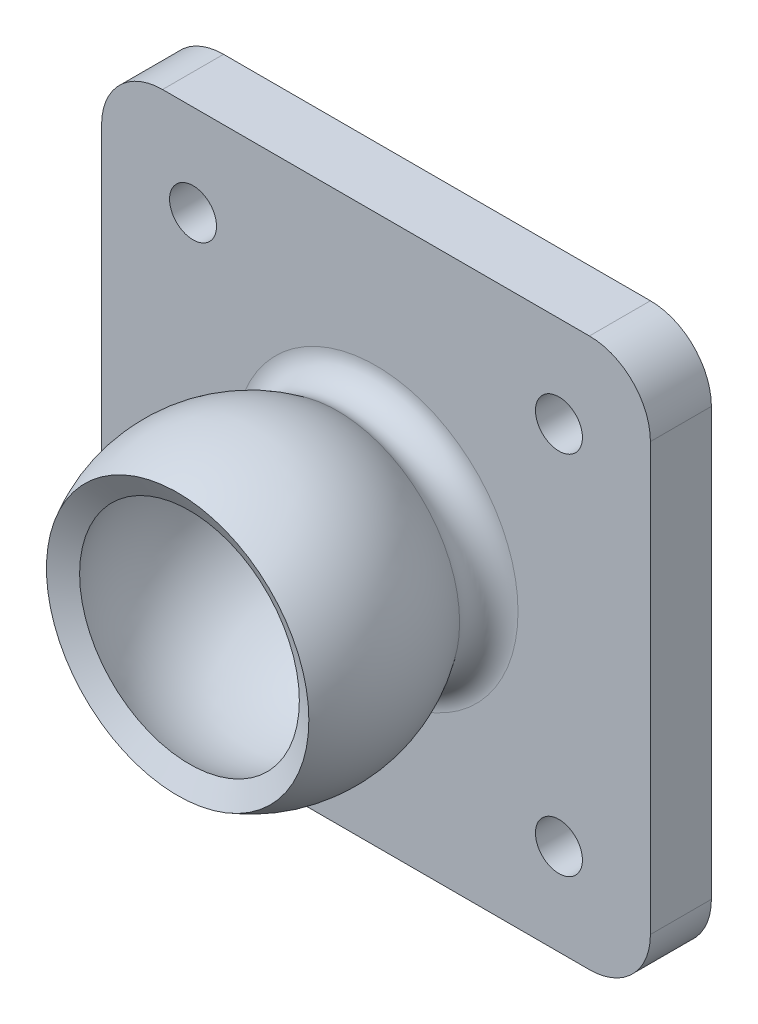
ISO-10303-21;
HEADER;
FILE_DESCRIPTION(('STEP AP214'),'2;1');
FILE_NAME('part.step','',(''),(''),'','','');
FILE_SCHEMA(('AUTOMOTIVE_DESIGN { 1 0 10303 214 1 1 1 1 }'));
ENDSEC;
DATA;
#1=APPLICATION_CONTEXT('core data for automotive mechanical design processes');
#2=APPLICATION_PROTOCOL_DEFINITION('international standard','automotive_design',2000,#1);
#3=PRODUCT_CONTEXT('',#1,'mechanical');
#4=PRODUCT('Part','Part','',(#3));
#5=PRODUCT_RELATED_PRODUCT_CATEGORY('part','',(#4));
#6=PRODUCT_DEFINITION_FORMATION('','',#4);
#7=PRODUCT_DEFINITION_CONTEXT('part definition',#1,'design');
#8=PRODUCT_DEFINITION('design','',#6,#7);
#9=PRODUCT_DEFINITION_SHAPE('','',#8);
#10=(LENGTH_UNIT() NAMED_UNIT(*) SI_UNIT(.MILLI.,.METRE.));
#11=(NAMED_UNIT(*) PLANE_ANGLE_UNIT() SI_UNIT($,.RADIAN.));
#12=(NAMED_UNIT(*) SI_UNIT($,.STERADIAN.) SOLID_ANGLE_UNIT());
#13=UNCERTAINTY_MEASURE_WITH_UNIT(LENGTH_MEASURE(1.E-05),#10,'distance_accuracy_value','');
#14=(GEOMETRIC_REPRESENTATION_CONTEXT(3) GLOBAL_UNCERTAINTY_ASSIGNED_CONTEXT((#13)) GLOBAL_UNIT_ASSIGNED_CONTEXT((#10,
#11,#12)) REPRESENTATION_CONTEXT('',''));
#15=CARTESIAN_POINT('',(0.,0.,0.));
#16=DIRECTION('',(0.,0.,1.));
#17=DIRECTION('',(1.,0.,0.));
#18=AXIS2_PLACEMENT_3D('',#15,#16,#17);
#19=CARTESIAN_POINT('',(0.,0.,15.3));
#20=DIRECTION('',(0.,0.,-1.));
#21=DIRECTION('',(-1.,0.,0.));
#22=AXIS2_PLACEMENT_3D('',#19,#20,#21);
#23=SPHERICAL_SURFACE('',#22,10.3);
#24=CARTESIAN_POINT('',(0.,0.,5.));
#25=VERTEX_POINT('',#24);
#26=VERTEX_LOOP('',#25);
#27=FACE_BOUND('',#26,.T.);
#28=CARTESIAN_POINT('',(0.,0.,20.2935390885373));
#29=DIRECTION('',(0.,0.,-1.));
#30=DIRECTION('',(-1.,0.,0.));
#31=AXIS2_PLACEMENT_3D('',#28,#29,#30);
#32=CIRCLE('',#31,9.00858298353579);
#33=CARTESIAN_POINT('',(-9.00858298353579,0.,20.2935390885373));
#34=VERTEX_POINT('',#33);
#35=EDGE_CURVE('E49',#34,#34,#32,.T.);
#36=ORIENTED_EDGE('',*,*,#35,.F.);
#37=EDGE_LOOP('',(#36));
#38=FACE_BOUND('',#37,.T.);
#39=ADVANCED_FACE('F45',(#27,#38),#23,.F.);
#40=CARTESIAN_POINT('',(0.,0.,21.2631583290299));
#41=DIRECTION('',(0.,0.,1.));
#42=DIRECTION('',(1.,0.,0.));
#43=AXIS2_PLACEMENT_3D('',#40,#41,#42);
#44=CONICAL_SURFACE('',#43,10.7578223978146,1.06465084371654);
#45=CARTESIAN_POINT('',(0.,0.,21.2631583290299));
#46=DIRECTION('',(0.,0.,-1.));
#47=DIRECTION('',(-1.,0.,0.));
#48=AXIS2_PLACEMENT_3D('',#45,#46,#47);
#49=CIRCLE('',#48,10.7578223978146);
#50=CARTESIAN_POINT('',(10.7578223978146,0.,21.2631583290299));
#51=VERTEX_POINT('',#50);
#52=EDGE_CURVE('E124',#51,#51,#49,.T.);
#53=ORIENTED_EDGE('',*,*,#52,.F.);
#54=EDGE_LOOP('',(#53));
#55=FACE_BOUND('',#54,.T.);
#56=ORIENTED_EDGE('',*,*,#35,.T.);
#57=EDGE_LOOP('',(#56));
#58=FACE_BOUND('',#57,.T.);
#59=ADVANCED_FACE('F117',(#55,#58),#44,.F.);
#60=CARTESIAN_POINT('',(0.,0.,15.3));
#61=DIRECTION('',(0.,0.,-1.));
#62=DIRECTION('',(1.,0.,0.));
#63=AXIS2_PLACEMENT_3D('',#60,#61,#62);
#64=SPHERICAL_SURFACE('',#63,12.3);
#65=CARTESIAN_POINT('',(0.,0.,8.16083916083916));
#66=DIRECTION('',(0.,0.,1.));
#67=DIRECTION('',(1.,0.,0.));
#68=AXIS2_PLACEMENT_3D('',#65,#66,#67);
#69=CIRCLE('',#68,10.0161061552178);
#70=CARTESIAN_POINT('',(10.0161061552178,0.,8.16083916083916));
#71=VERTEX_POINT('',#70);
#72=EDGE_CURVE('E55',#71,#71,#69,.T.);
#73=CARTESIAN_POINT('',(10.0161061552178,0.,8.16083916083916));
#74=CARTESIAN_POINT('',(10.0997980883156,0.,8.27825540371457));
#75=CARTESIAN_POINT('',(10.1814234987795,0.,8.39714451375462));
#76=CARTESIAN_POINT('',(10.3404444546911,0.,8.63771871213522));
#77=CARTESIAN_POINT('',(10.4178400001386,0.,8.75940380047577));
#78=CARTESIAN_POINT('',(10.5683044062684,0.,9.00542019942862));
#79=CARTESIAN_POINT('',(10.6413732669507,0.,9.12975151004092));
#80=CARTESIAN_POINT('',(10.7830942362201,0.,9.3809063984481));
#81=CARTESIAN_POINT('',(10.8517463448071,0.,9.50772997624298));
#82=CARTESIAN_POINT('',(10.9845488291381,0.,9.76371261002001));
#83=CARTESIAN_POINT('',(11.0486992048822,0.,9.89287166600217));
#84=CARTESIAN_POINT('',(11.1724189106616,0.,10.1533655123758));
#85=CARTESIAN_POINT('',(11.2319882406971,0.,10.2847003027673));
#86=CARTESIAN_POINT('',(11.3464721805628,0.,10.5493832012965));
#87=CARTESIAN_POINT('',(11.4013867903931,0.,10.6827313094342));
#88=CARTESIAN_POINT('',(11.5064933790232,0.,10.9512759321669));
#89=CARTESIAN_POINT('',(11.5566853578231,0.,11.0864724467618));
#90=CARTESIAN_POINT('',(11.6522846120621,0.,11.3585466864937));
#91=CARTESIAN_POINT('',(11.6976918875011,0.,11.4954244116306));
#92=CARTESIAN_POINT('',(11.783665580402,0.,11.7706917970519));
#93=CARTESIAN_POINT('',(11.8242319978638,0.,11.9090814573363));
#94=CARTESIAN_POINT('',(11.9004738066954,0.,12.1872015679547));
#95=CARTESIAN_POINT('',(11.9361491980652,0.,12.3269320182888));
#96=CARTESIAN_POINT('',(12.002564835319,0.,12.6075609057425));
#97=CARTESIAN_POINT('',(12.033305081203,0.,12.7484593428622));
#98=CARTESIAN_POINT('',(12.0898124113263,0.,13.0312499561919));
#99=CARTESIAN_POINT('',(12.1155794955657,0.,13.1731421324019));
#100=CARTESIAN_POINT('',(12.1621086365037,0.,13.4577447472682));
#101=CARTESIAN_POINT('',(12.1828706932022,0.,13.6004551859244));
#102=CARTESIAN_POINT('',(12.219364102829,0.,13.8865178371023));
#103=CARTESIAN_POINT('',(12.2350954557573,0.,14.0298700496239));
#104=CARTESIAN_POINT('',(12.2615080030361,0.,14.3170389662764));
#105=CARTESIAN_POINT('',(12.2721891973864,0.,14.4608556704073));
#106=CARTESIAN_POINT('',(12.2884882181824,0.,14.7487757135897));
#107=CARTESIAN_POINT('',(12.294106044628,0.,14.8928790526414));
#108=CARTESIAN_POINT('',(12.3002713821042,0.,15.1811941544986));
#109=CARTESIAN_POINT('',(12.3008188931348,0.,15.3254059173041));
#110=CARTESIAN_POINT('',(12.2968429226797,0.,15.6137595214156));
#111=CARTESIAN_POINT('',(12.2923194411939,0.,15.7579013627214));
#112=CARTESIAN_POINT('',(12.2782070798506,0.,16.0459368650514));
#113=CARTESIAN_POINT('',(12.2686181999932,0.,16.1898305260754));
#114=CARTESIAN_POINT('',(12.2443869003784,0.,16.4771917159811));
#115=CARTESIAN_POINT('',(12.2297444806211,0.,16.6206592448628));
#116=CARTESIAN_POINT('',(12.1954242093437,0.,16.9069907456181));
#117=CARTESIAN_POINT('',(12.1757463578237,0.,17.0498547174918));
#118=CARTESIAN_POINT('',(12.131379558416,0.,17.3348024257729));
#119=CARTESIAN_POINT('',(12.1066906105283,0.,17.4768861621803));
#120=CARTESIAN_POINT('',(12.052332150993,0.,17.7600976860007));
#121=CARTESIAN_POINT('',(12.0226626393454,0.,17.9012254734135));
#122=CARTESIAN_POINT('',(11.9583797441634,0.,18.1823505678532));
#123=CARTESIAN_POINT('',(11.9237663606289,0.,18.32234787488));
#124=CARTESIAN_POINT('',(11.8496385281374,0.,18.6010388754922));
#125=CARTESIAN_POINT('',(11.8101240791804,0.,18.7397325690775));
#126=CARTESIAN_POINT('',(11.7262429813392,0.,19.0156448208642));
#127=CARTESIAN_POINT('',(11.6818763324549,0.,19.1528633790654));
#128=CARTESIAN_POINT('',(11.5883457086397,0.,19.4256556663563));
#129=CARTESIAN_POINT('',(11.5391817337088,0.,19.5612293954461));
#130=CARTESIAN_POINT('',(11.4361172356823,0.,19.8305643502635));
#131=CARTESIAN_POINT('',(11.3822167125868,0.,19.9643255759911));
#132=CARTESIAN_POINT('',(11.2697458612535,0.,20.2298701460765));
#133=CARTESIAN_POINT('',(11.2111755330157,0.,20.3616534904342));
#134=CARTESIAN_POINT('',(11.0894371883326,0.,20.623079161514));
#135=CARTESIAN_POINT('',(11.0262691718873,0.,20.7527214882362));
#136=CARTESIAN_POINT('',(10.8954147508978,0.,21.0097053979523));
#137=CARTESIAN_POINT('',(10.8277283463537,0.,21.1370469809463));
#138=CARTESIAN_POINT('',(10.7578223978146,0.,21.2631583290299));
#139=B_SPLINE_CURVE_WITH_KNOTS('',3,(#73,#74,#75,#76,#77,#78,#79,#80,#81,#82,#83,#84,#85,#86,
#87,#88,#89,#90,#91,#92,#93,#94,#95,#96,#97,#98,#99,#100,#101,#102,#103,#104,#105,#106,#107,
#108,#109,#110,#111,#112,#113,#114,#115,#116,#117,#118,#119,#120,#121,#122,#123,#124,#125,#126,
#127,#128,#129,#130,#131,#132,#133,#134,#135,#136,#137,#138),.UNSPECIFIED.,.F.,.F.,(4,2,2,2,2,2,
2,2,2,2,2,2,2,2,2,2,2,2,2,2,2,2,2,2,2,2,2,2,2,2,2,2,4),(0.,0.432549233137449,0.865098466274895,
1.29764769941234,1.73019693254979,2.16274616568724,2.59529539882468,3.02784463196213,
3.46039386509958,3.89294309823702,4.32549233137447,4.75804156451192,5.19059079764936,
5.62314003078681,6.05568926392426,6.4882384970617,6.92078773019915,7.3533369633366,
7.78588619647405,8.21843542961149,8.65098466274894,9.08353389588638,9.51608312902383,
9.94863236216128,10.3811815952987,10.8137308284362,11.2462800615736,11.6788292947111,
12.1113785278485,12.543927760986,12.9764769941234,13.4090262272609,13.8415754603983),.UNSPECIFIED.);
#140=EDGE_CURVE('BSEAM245',#71,#51,#139,.T.);
#141=ORIENTED_EDGE('',*,*,#72,.T.);
#142=ORIENTED_EDGE('',*,*,#52,.T.);
#143=ORIENTED_EDGE('',*,*,#140,.T.);
#144=ORIENTED_EDGE('',*,*,#140,.F.);
#145=EDGE_LOOP('',(#141,#143,#142,#144));
#146=FACE_BOUND('',#145,.T.);
#147=ADVANCED_FACE('F245',(#146),#64,.T.);
#148=CARTESIAN_POINT('',(22.5,-22.5,5.));
#149=DIRECTION('',(-1.,0.,0.));
#150=DIRECTION('',(0.,0.,1.));
#151=AXIS2_PLACEMENT_3D('',#148,#149,#150);
#152=PLANE('',#151);
#153=DIRECTION('',(0.,1.,0.));
#154=VECTOR('',#153,1.);
#155=CARTESIAN_POINT('',(22.5,-22.5,5.));
#156=LINE('',#155,#154);
#157=CARTESIAN_POINT('',(22.5,-17.5,5.));
#158=VERTEX_POINT('',#157);
#159=CARTESIAN_POINT('',(22.5,17.5,5.));
#160=VERTEX_POINT('',#159);
#161=EDGE_CURVE('E165',#158,#160,#156,.T.);
#162=ORIENTED_EDGE('',*,*,#161,.F.);
#163=DIRECTION('',(0.,0.,-1.));
#164=VECTOR('',#163,1.);
#165=CARTESIAN_POINT('',(22.5,-17.5,5.));
#166=LINE('',#165,#164);
#167=CARTESIAN_POINT('',(22.5,-17.5,0.));
#168=VERTEX_POINT('',#167);
#169=EDGE_CURVE('E196',#158,#168,#166,.T.);
#170=ORIENTED_EDGE('',*,*,#169,.T.);
#171=DIRECTION('',(0.,1.,0.));
#172=VECTOR('',#171,1.);
#173=CARTESIAN_POINT('',(22.5,-22.5,0.));
#174=LINE('',#173,#172);
#175=CARTESIAN_POINT('',(22.5,17.5,0.));
#176=VERTEX_POINT('',#175);
#177=EDGE_CURVE('E161',#168,#176,#174,.T.);
#178=ORIENTED_EDGE('',*,*,#177,.T.);
#179=DIRECTION('',(0.,0.,-1.));
#180=VECTOR('',#179,1.);
#181=CARTESIAN_POINT('',(22.5,17.5,5.));
#182=LINE('',#181,#180);
#183=EDGE_CURVE('E180',#176,#160,#182,.F.);
#184=ORIENTED_EDGE('',*,*,#183,.T.);
#185=EDGE_LOOP('',(#162,#170,#178,#184));
#186=FACE_BOUND('',#185,.T.);
#187=ADVANCED_FACE('F282',(#186),#152,.F.);
#188=CARTESIAN_POINT('',(-22.5,22.5,5.));
#189=DIRECTION('',(0.,-1.,0.));
#190=DIRECTION('',(0.,0.,-1.));
#191=AXIS2_PLACEMENT_3D('',#188,#189,#190);
#192=PLANE('',#191);
#193=DIRECTION('',(-1.,0.,0.));
#194=VECTOR('',#193,1.);
#195=CARTESIAN_POINT('',(-22.5,22.5,0.));
#196=LINE('',#195,#194);
#197=CARTESIAN_POINT('',(17.5,22.5,0.));
#198=VERTEX_POINT('',#197);
#199=CARTESIAN_POINT('',(-17.5,22.5,0.));
#200=VERTEX_POINT('',#199);
#201=EDGE_CURVE('E184',#198,#200,#196,.T.);
#202=ORIENTED_EDGE('',*,*,#201,.T.);
#203=DIRECTION('',(0.,0.,-1.));
#204=VECTOR('',#203,1.);
#205=CARTESIAN_POINT('',(-17.5,22.5,5.));
#206=LINE('',#205,#204);
#207=CARTESIAN_POINT('',(-17.5,22.5,5.));
#208=VERTEX_POINT('',#207);
#209=EDGE_CURVE('E238',#200,#208,#206,.F.);
#210=ORIENTED_EDGE('',*,*,#209,.T.);
#211=DIRECTION('',(-1.,0.,0.));
#212=VECTOR('',#211,1.);
#213=CARTESIAN_POINT('',(-22.5,22.5,5.));
#214=LINE('',#213,#212);
#215=CARTESIAN_POINT('',(17.5,22.5,5.));
#216=VERTEX_POINT('',#215);
#217=EDGE_CURVE('E169',#216,#208,#214,.T.);
#218=ORIENTED_EDGE('',*,*,#217,.F.);
#219=DIRECTION('',(0.,0.,-1.));
#220=VECTOR('',#219,1.);
#221=CARTESIAN_POINT('',(17.5,22.5,5.));
#222=LINE('',#221,#220);
#223=EDGE_CURVE('E234',#216,#198,#222,.T.);
#224=ORIENTED_EDGE('',*,*,#223,.T.);
#225=EDGE_LOOP('',(#202,#210,#218,#224));
#226=FACE_BOUND('',#225,.T.);
#227=ADVANCED_FACE('F293',(#226),#192,.F.);
#228=CARTESIAN_POINT('',(-22.5,-22.5,5.));
#229=DIRECTION('',(1.,0.,0.));
#230=DIRECTION('',(0.,0.,-1.));
#231=AXIS2_PLACEMENT_3D('',#228,#229,#230);
#232=PLANE('',#231);
#233=DIRECTION('',(0.,-1.,0.));
#234=VECTOR('',#233,1.);
#235=CARTESIAN_POINT('',(-22.5,-22.5,0.));
#236=LINE('',#235,#234);
#237=CARTESIAN_POINT('',(-22.5,17.5,0.));
#238=VERTEX_POINT('',#237);
#239=CARTESIAN_POINT('',(-22.5,-17.5,0.));
#240=VERTEX_POINT('',#239);
#241=EDGE_CURVE('E188',#238,#240,#236,.T.);
#242=ORIENTED_EDGE('',*,*,#241,.T.);
#243=DIRECTION('',(0.,0.,-1.));
#244=VECTOR('',#243,1.);
#245=CARTESIAN_POINT('',(-22.5,-17.5,5.));
#246=LINE('',#245,#244);
#247=CARTESIAN_POINT('',(-22.5,-17.5,5.));
#248=VERTEX_POINT('',#247);
#249=EDGE_CURVE('E62',#240,#248,#246,.F.);
#250=ORIENTED_EDGE('',*,*,#249,.T.);
#251=DIRECTION('',(0.,-1.,0.));
#252=VECTOR('',#251,1.);
#253=CARTESIAN_POINT('',(-22.5,-22.5,5.));
#254=LINE('',#253,#252);
#255=CARTESIAN_POINT('',(-22.5,17.5,5.));
#256=VERTEX_POINT('',#255);
#257=EDGE_CURVE('E173',#256,#248,#254,.T.);
#258=ORIENTED_EDGE('',*,*,#257,.F.);
#259=DIRECTION('',(0.,0.,-1.));
#260=VECTOR('',#259,1.);
#261=CARTESIAN_POINT('',(-22.5,17.5,5.));
#262=LINE('',#261,#260);
#263=EDGE_CURVE('E228',#256,#238,#262,.T.);
#264=ORIENTED_EDGE('',*,*,#263,.T.);
#265=EDGE_LOOP('',(#242,#250,#258,#264));
#266=FACE_BOUND('',#265,.T.);
#267=ADVANCED_FACE('F299',(#266),#232,.F.);
#268=CARTESIAN_POINT('',(-22.5,-22.5,5.));
#269=DIRECTION('',(0.,1.,0.));
#270=DIRECTION('',(0.,0.,1.));
#271=AXIS2_PLACEMENT_3D('',#268,#269,#270);
#272=PLANE('',#271);
#273=DIRECTION('',(1.,0.,0.));
#274=VECTOR('',#273,1.);
#275=CARTESIAN_POINT('',(-22.5,-22.5,0.));
#276=LINE('',#275,#274);
#277=CARTESIAN_POINT('',(-17.5,-22.5,0.));
#278=VERTEX_POINT('',#277);
#279=CARTESIAN_POINT('',(17.5,-22.5,0.));
#280=VERTEX_POINT('',#279);
#281=EDGE_CURVE('E170',#278,#280,#276,.T.);
#282=ORIENTED_EDGE('',*,*,#281,.T.);
#283=DIRECTION('',(0.,0.,-1.));
#284=VECTOR('',#283,1.);
#285=CARTESIAN_POINT('',(17.5,-22.5,5.));
#286=LINE('',#285,#284);
#287=CARTESIAN_POINT('',(17.5,-22.5,5.));
#288=VERTEX_POINT('',#287);
#289=EDGE_CURVE('E215',#280,#288,#286,.F.);
#290=ORIENTED_EDGE('',*,*,#289,.T.);
#291=DIRECTION('',(1.,0.,0.));
#292=VECTOR('',#291,1.);
#293=CARTESIAN_POINT('',(-22.5,-22.5,5.));
#294=LINE('',#293,#292);
#295=CARTESIAN_POINT('',(-17.5,-22.5,5.));
#296=VERTEX_POINT('',#295);
#297=EDGE_CURVE('E176',#296,#288,#294,.T.);
#298=ORIENTED_EDGE('',*,*,#297,.F.);
#299=DIRECTION('',(0.,0.,-1.));
#300=VECTOR('',#299,1.);
#301=CARTESIAN_POINT('',(-17.5,-22.5,5.));
#302=LINE('',#301,#300);
#303=EDGE_CURVE('E211',#296,#278,#302,.T.);
#304=ORIENTED_EDGE('',*,*,#303,.T.);
#305=EDGE_LOOP('',(#282,#290,#298,#304));
#306=FACE_BOUND('',#305,.T.);
#307=ADVANCED_FACE('F261',(#306),#272,.F.);
#308=CARTESIAN_POINT('',(0.,0.,5.));
#309=DIRECTION('',(0.,0.,-1.));
#310=DIRECTION('',(-1.,0.,0.));
#311=AXIS2_PLACEMENT_3D('',#308,#309,#310);
#312=PLANE('',#311);
#313=CARTESIAN_POINT('',(0.,0.,5.));
#314=DIRECTION('',(0.,0.,-1.));
#315=DIRECTION('',(-1.,0.,0.));
#316=AXIS2_PLACEMENT_3D('',#313,#314,#315);
#317=CIRCLE('',#316,11.6447413024077);
#318=CARTESIAN_POINT('',(-11.6447413024077,0.,5.));
#319=VERTEX_POINT('',#318);
#320=EDGE_CURVE('E11',#319,#319,#317,.T.);
#321=ORIENTED_EDGE('',*,*,#320,.T.);
#322=EDGE_LOOP('',(#321));
#323=FACE_BOUND('',#322,.T.);
#324=CARTESIAN_POINT('',(-15.,15.,5.));
#325=DIRECTION('',(0.,0.,1.));
#326=DIRECTION('',(-1.,0.,0.));
#327=AXIS2_PLACEMENT_3D('',#324,#325,#326);
#328=CIRCLE('',#327,1.925);
#329=CARTESIAN_POINT('',(-16.925,15.,5.));
#330=VERTEX_POINT('',#329);
#331=EDGE_CURVE('E129',#330,#330,#328,.T.);
#332=ORIENTED_EDGE('',*,*,#331,.F.);
#333=EDGE_LOOP('',(#332));
#334=FACE_BOUND('',#333,.T.);
#335=CARTESIAN_POINT('',(-15.,-15.,5.));
#336=DIRECTION('',(0.,0.,1.));
#337=DIRECTION('',(1.,0.,0.));
#338=AXIS2_PLACEMENT_3D('',#335,#336,#337);
#339=CIRCLE('',#338,1.925);
#340=CARTESIAN_POINT('',(-13.075,-15.,5.));
#341=VERTEX_POINT('',#340);
#342=EDGE_CURVE('E147',#341,#341,#339,.T.);
#343=ORIENTED_EDGE('',*,*,#342,.F.);
#344=EDGE_LOOP('',(#343));
#345=FACE_BOUND('',#344,.T.);
#346=CARTESIAN_POINT('',(15.,-15.,5.));
#347=DIRECTION('',(0.,0.,1.));
#348=DIRECTION('',(-1.,0.,0.));
#349=AXIS2_PLACEMENT_3D('',#346,#347,#348);
#350=CIRCLE('',#349,1.925);
#351=CARTESIAN_POINT('',(13.075,-15.,5.));
#352=VERTEX_POINT('',#351);
#353=EDGE_CURVE('E139',#352,#352,#350,.T.);
#354=ORIENTED_EDGE('',*,*,#353,.F.);
#355=EDGE_LOOP('',(#354));
#356=FACE_BOUND('',#355,.T.);
#357=CARTESIAN_POINT('',(15.,15.,5.));
#358=DIRECTION('',(0.,0.,1.));
#359=DIRECTION('',(1.,0.,0.));
#360=AXIS2_PLACEMENT_3D('',#357,#358,#359);
#361=CIRCLE('',#360,1.925);
#362=CARTESIAN_POINT('',(16.925,15.,5.));
#363=VERTEX_POINT('',#362);
#364=EDGE_CURVE('E142',#363,#363,#361,.T.);
#365=ORIENTED_EDGE('',*,*,#364,.F.);
#366=EDGE_LOOP('',(#365));
#367=FACE_BOUND('',#366,.T.);
#368=ORIENTED_EDGE('',*,*,#297,.T.);
#369=CARTESIAN_POINT('',(17.5,-17.5,5.));
#370=DIRECTION('',(0.,0.,-1.));
#371=DIRECTION('',(-1.,0.,0.));
#372=AXIS2_PLACEMENT_3D('',#369,#370,#371);
#373=CIRCLE('',#372,5.);
#374=EDGE_CURVE('E225',#288,#158,#373,.F.);
#375=ORIENTED_EDGE('',*,*,#374,.T.);
#376=ORIENTED_EDGE('',*,*,#161,.T.);
#377=CARTESIAN_POINT('',(17.5,17.5,5.));
#378=DIRECTION('',(0.,0.,-1.));
#379=DIRECTION('',(-1.,0.,0.));
#380=AXIS2_PLACEMENT_3D('',#377,#378,#379);
#381=CIRCLE('',#380,5.);
#382=EDGE_CURVE('E217',#160,#216,#381,.F.);
#383=ORIENTED_EDGE('',*,*,#382,.T.);
#384=ORIENTED_EDGE('',*,*,#217,.T.);
#385=CARTESIAN_POINT('',(-17.5,17.5,5.));
#386=DIRECTION('',(0.,0.,-1.));
#387=DIRECTION('',(-1.,0.,0.));
#388=AXIS2_PLACEMENT_3D('',#385,#386,#387);
#389=CIRCLE('',#388,5.);
#390=EDGE_CURVE('E69',#208,#256,#389,.F.);
#391=ORIENTED_EDGE('',*,*,#390,.T.);
#392=ORIENTED_EDGE('',*,*,#257,.T.);
#393=CARTESIAN_POINT('',(-17.5,-17.5,5.));
#394=DIRECTION('',(0.,0.,-1.));
#395=DIRECTION('',(-1.,0.,0.));
#396=AXIS2_PLACEMENT_3D('',#393,#394,#395);
#397=CIRCLE('',#396,5.);
#398=EDGE_CURVE('E222',#248,#296,#397,.F.);
#399=ORIENTED_EDGE('',*,*,#398,.T.);
#400=EDGE_LOOP('',(#368,#375,#376,#383,#384,#391,#392,#399));
#401=FACE_BOUND('',#400,.T.);
#402=ADVANCED_FACE('F257',(#323,#334,#345,#356,#367,#401),#312,.F.);
#403=CARTESIAN_POINT('',(0.,0.,0.));
#404=DIRECTION('',(0.,0.,-1.));
#405=DIRECTION('',(-1.,0.,0.));
#406=AXIS2_PLACEMENT_3D('',#403,#404,#405);
#407=PLANE('',#406);
#408=CARTESIAN_POINT('',(-15.,15.,0.));
#409=DIRECTION('',(0.,0.,1.));
#410=DIRECTION('',(-1.,0.,0.));
#411=AXIS2_PLACEMENT_3D('',#408,#409,#410);
#412=CIRCLE('',#411,1.925);
#413=CARTESIAN_POINT('',(-16.925,15.,0.));
#414=VERTEX_POINT('',#413);
#415=EDGE_CURVE('E123',#414,#414,#412,.T.);
#416=ORIENTED_EDGE('',*,*,#415,.T.);
#417=EDGE_LOOP('',(#416));
#418=FACE_BOUND('',#417,.T.);
#419=CARTESIAN_POINT('',(-15.,-15.,0.));
#420=DIRECTION('',(0.,0.,1.));
#421=DIRECTION('',(1.,0.,0.));
#422=AXIS2_PLACEMENT_3D('',#419,#420,#421);
#423=CIRCLE('',#422,1.925);
#424=CARTESIAN_POINT('',(-13.075,-15.,0.));
#425=VERTEX_POINT('',#424);
#426=EDGE_CURVE('E151',#425,#425,#423,.T.);
#427=ORIENTED_EDGE('',*,*,#426,.T.);
#428=EDGE_LOOP('',(#427));
#429=FACE_BOUND('',#428,.T.);
#430=CARTESIAN_POINT('',(15.,-15.,0.));
#431=DIRECTION('',(0.,0.,1.));
#432=DIRECTION('',(-1.,0.,0.));
#433=AXIS2_PLACEMENT_3D('',#430,#431,#432);
#434=CIRCLE('',#433,1.925);
#435=CARTESIAN_POINT('',(13.075,-15.,0.));
#436=VERTEX_POINT('',#435);
#437=EDGE_CURVE('E143',#436,#436,#434,.T.);
#438=ORIENTED_EDGE('',*,*,#437,.T.);
#439=EDGE_LOOP('',(#438));
#440=FACE_BOUND('',#439,.T.);
#441=CARTESIAN_POINT('',(15.,15.,0.));
#442=DIRECTION('',(0.,0.,1.));
#443=DIRECTION('',(1.,0.,0.));
#444=AXIS2_PLACEMENT_3D('',#441,#442,#443);
#445=CIRCLE('',#444,1.925);
#446=CARTESIAN_POINT('',(16.925,15.,0.));
#447=VERTEX_POINT('',#446);
#448=EDGE_CURVE('E158',#447,#447,#445,.T.);
#449=ORIENTED_EDGE('',*,*,#448,.T.);
#450=EDGE_LOOP('',(#449));
#451=FACE_BOUND('',#450,.T.);
#452=ORIENTED_EDGE('',*,*,#177,.F.);
#453=CARTESIAN_POINT('',(17.5,-17.5,0.));
#454=DIRECTION('',(0.,0.,-1.));
#455=DIRECTION('',(-1.,0.,0.));
#456=AXIS2_PLACEMENT_3D('',#453,#454,#455);
#457=CIRCLE('',#456,5.);
#458=EDGE_CURVE('E208',#168,#280,#457,.T.);
#459=ORIENTED_EDGE('',*,*,#458,.T.);
#460=ORIENTED_EDGE('',*,*,#281,.F.);
#461=CARTESIAN_POINT('',(-17.5,-17.5,0.));
#462=DIRECTION('',(0.,0.,-1.));
#463=DIRECTION('',(-1.,0.,0.));
#464=AXIS2_PLACEMENT_3D('',#461,#462,#463);
#465=CIRCLE('',#464,5.);
#466=EDGE_CURVE('E206',#278,#240,#465,.T.);
#467=ORIENTED_EDGE('',*,*,#466,.T.);
#468=ORIENTED_EDGE('',*,*,#241,.F.);
#469=CARTESIAN_POINT('',(-17.5,17.5,0.));
#470=DIRECTION('',(0.,0.,-1.));
#471=DIRECTION('',(-1.,0.,0.));
#472=AXIS2_PLACEMENT_3D('',#469,#470,#471);
#473=CIRCLE('',#472,5.);
#474=EDGE_CURVE('E203',#238,#200,#473,.T.);
#475=ORIENTED_EDGE('',*,*,#474,.T.);
#476=ORIENTED_EDGE('',*,*,#201,.F.);
#477=CARTESIAN_POINT('',(17.5,17.5,0.));
#478=DIRECTION('',(0.,0.,-1.));
#479=DIRECTION('',(-1.,0.,0.));
#480=AXIS2_PLACEMENT_3D('',#477,#478,#479);
#481=CIRCLE('',#480,5.);
#482=EDGE_CURVE('E200',#198,#176,#481,.T.);
#483=ORIENTED_EDGE('',*,*,#482,.T.);
#484=EDGE_LOOP('',(#452,#459,#460,#467,#468,#475,#476,#483));
#485=FACE_BOUND('',#484,.T.);
#486=ADVANCED_FACE('F260',(#418,#429,#440,#451,#485),#407,.T.);
#487=CARTESIAN_POINT('',(17.5,-17.5,5.));
#488=DIRECTION('',(0.,0.,-1.));
#489=DIRECTION('',(-1.,0.,0.));
#490=AXIS2_PLACEMENT_3D('',#487,#488,#489);
#491=CYLINDRICAL_SURFACE('',#490,5.);
#492=ORIENTED_EDGE('',*,*,#374,.F.);
#493=ORIENTED_EDGE('',*,*,#289,.F.);
#494=ORIENTED_EDGE('',*,*,#458,.F.);
#495=ORIENTED_EDGE('',*,*,#169,.F.);
#496=EDGE_LOOP('',(#492,#493,#494,#495));
#497=FACE_BOUND('',#496,.T.);
#498=ADVANCED_FACE('F279',(#497),#491,.T.);
#499=CARTESIAN_POINT('',(-17.5,-17.5,5.));
#500=DIRECTION('',(0.,0.,-1.));
#501=DIRECTION('',(-1.,0.,0.));
#502=AXIS2_PLACEMENT_3D('',#499,#500,#501);
#503=CYLINDRICAL_SURFACE('',#502,5.);
#504=ORIENTED_EDGE('',*,*,#398,.F.);
#505=ORIENTED_EDGE('',*,*,#249,.F.);
#506=ORIENTED_EDGE('',*,*,#466,.F.);
#507=ORIENTED_EDGE('',*,*,#303,.F.);
#508=EDGE_LOOP('',(#504,#505,#506,#507));
#509=FACE_BOUND('',#508,.T.);
#510=ADVANCED_FACE('F301',(#509),#503,.T.);
#511=CARTESIAN_POINT('',(-17.5,17.5,5.));
#512=DIRECTION('',(0.,0.,-1.));
#513=DIRECTION('',(-1.,0.,0.));
#514=AXIS2_PLACEMENT_3D('',#511,#512,#513);
#515=CYLINDRICAL_SURFACE('',#514,5.);
#516=ORIENTED_EDGE('',*,*,#390,.F.);
#517=ORIENTED_EDGE('',*,*,#209,.F.);
#518=ORIENTED_EDGE('',*,*,#474,.F.);
#519=ORIENTED_EDGE('',*,*,#263,.F.);
#520=EDGE_LOOP('',(#516,#517,#518,#519));
#521=FACE_BOUND('',#520,.T.);
#522=ADVANCED_FACE('F297',(#521),#515,.T.);
#523=CARTESIAN_POINT('',(17.5,17.5,5.));
#524=DIRECTION('',(0.,0.,-1.));
#525=DIRECTION('',(-1.,0.,0.));
#526=AXIS2_PLACEMENT_3D('',#523,#524,#525);
#527=CYLINDRICAL_SURFACE('',#526,5.);
#528=ORIENTED_EDGE('',*,*,#382,.F.);
#529=ORIENTED_EDGE('',*,*,#183,.F.);
#530=ORIENTED_EDGE('',*,*,#482,.F.);
#531=ORIENTED_EDGE('',*,*,#223,.F.);
#532=EDGE_LOOP('',(#528,#529,#530,#531));
#533=FACE_BOUND('',#532,.T.);
#534=ADVANCED_FACE('F290',(#533),#527,.T.);
#535=CARTESIAN_POINT('',(15.,15.,0.));
#536=DIRECTION('',(0.,0.,1.));
#537=DIRECTION('',(1.,0.,0.));
#538=AXIS2_PLACEMENT_3D('',#535,#536,#537);
#539=CYLINDRICAL_SURFACE('',#538,1.925);
#540=ORIENTED_EDGE('',*,*,#448,.F.);
#541=EDGE_LOOP('',(#540));
#542=FACE_BOUND('',#541,.T.);
#543=ORIENTED_EDGE('',*,*,#364,.T.);
#544=EDGE_LOOP('',(#543));
#545=FACE_BOUND('',#544,.T.);
#546=ADVANCED_FACE('F319',(#542,#545),#539,.F.);
#547=CARTESIAN_POINT('',(15.,-15.,0.));
#548=DIRECTION('',(0.,0.,1.));
#549=DIRECTION('',(1.,0.,0.));
#550=AXIS2_PLACEMENT_3D('',#547,#548,#549);
#551=CYLINDRICAL_SURFACE('',#550,1.925);
#552=ORIENTED_EDGE('',*,*,#437,.F.);
#553=EDGE_LOOP('',(#552));
#554=FACE_BOUND('',#553,.T.);
#555=ORIENTED_EDGE('',*,*,#353,.T.);
#556=EDGE_LOOP('',(#555));
#557=FACE_BOUND('',#556,.T.);
#558=ADVANCED_FACE('F322',(#554,#557),#551,.F.);
#559=CARTESIAN_POINT('',(-15.,-15.,0.));
#560=DIRECTION('',(0.,0.,1.));
#561=DIRECTION('',(1.,0.,0.));
#562=AXIS2_PLACEMENT_3D('',#559,#560,#561);
#563=CYLINDRICAL_SURFACE('',#562,1.925);
#564=ORIENTED_EDGE('',*,*,#426,.F.);
#565=EDGE_LOOP('',(#564));
#566=FACE_BOUND('',#565,.T.);
#567=ORIENTED_EDGE('',*,*,#342,.T.);
#568=EDGE_LOOP('',(#567));
#569=FACE_BOUND('',#568,.T.);
#570=ADVANCED_FACE('F252',(#566,#569),#563,.F.);
#571=CARTESIAN_POINT('',(-15.,15.,0.));
#572=DIRECTION('',(0.,0.,1.));
#573=DIRECTION('',(1.,0.,0.));
#574=AXIS2_PLACEMENT_3D('',#571,#572,#573);
#575=CYLINDRICAL_SURFACE('',#574,1.925);
#576=ORIENTED_EDGE('',*,*,#415,.F.);
#577=EDGE_LOOP('',(#576));
#578=FACE_BOUND('',#577,.T.);
#579=ORIENTED_EDGE('',*,*,#331,.T.);
#580=EDGE_LOOP('',(#579));
#581=FACE_BOUND('',#580,.T.);
#582=ADVANCED_FACE('F248',(#578,#581),#575,.F.);
#583=CARTESIAN_POINT('',(0.,0.,7.));
#584=DIRECTION('',(0.,0.,-1.));
#585=DIRECTION('',(-1.,0.,0.));
#586=AXIS2_PLACEMENT_3D('',#583,#584,#585);
#587=TOROIDAL_SURFACE('',#586,11.6447413024077,2.);
#588=ORIENTED_EDGE('',*,*,#320,.F.);
#589=EDGE_LOOP('',(#588));
#590=FACE_BOUND('',#589,.T.);
#591=ORIENTED_EDGE('',*,*,#72,.F.);
#592=EDGE_LOOP('',(#591));
#593=FACE_BOUND('',#592,.T.);
#594=ADVANCED_FACE('F47',(#590,#593),#587,.F.);
#595=CLOSED_SHELL('',(#39,#59,#147,#187,#227,#267,#307,#402,#486,#498,#510,#522,#534,#546,#558,
#570,#582,#594));
#596=MANIFOLD_SOLID_BREP('B2',#595);
#597=ADVANCED_BREP_SHAPE_REPRESENTATION('',(#18,#596),#14);
#598=SHAPE_DEFINITION_REPRESENTATION(#9,#597);
ENDSEC;
END-ISO-10303-21;
